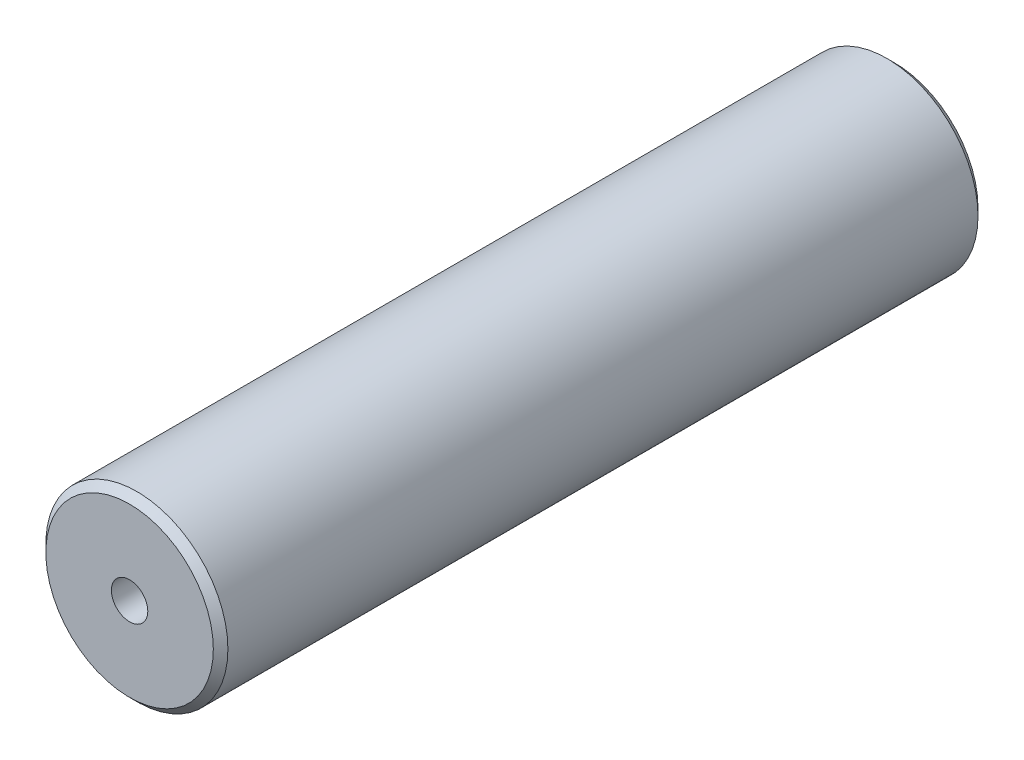
ISO-10303-21;
HEADER;
FILE_DESCRIPTION(('STEP AP214'),'2;1');
FILE_NAME('part.step','',(''),(''),'','','');
FILE_SCHEMA(('AUTOMOTIVE_DESIGN { 1 0 10303 214 1 1 1 1 }'));
ENDSEC;
DATA;
#1=APPLICATION_CONTEXT('core data for automotive mechanical design processes');
#2=APPLICATION_PROTOCOL_DEFINITION('international standard','automotive_design',2000,#1);
#3=PRODUCT_CONTEXT('',#1,'mechanical');
#4=PRODUCT('Part','Part','',(#3));
#5=PRODUCT_RELATED_PRODUCT_CATEGORY('part','',(#4));
#6=PRODUCT_DEFINITION_FORMATION('','',#4);
#7=PRODUCT_DEFINITION_CONTEXT('part definition',#1,'design');
#8=PRODUCT_DEFINITION('design','',#6,#7);
#9=PRODUCT_DEFINITION_SHAPE('','',#8);
#10=(LENGTH_UNIT() NAMED_UNIT(*) SI_UNIT(.MILLI.,.METRE.));
#11=(NAMED_UNIT(*) PLANE_ANGLE_UNIT() SI_UNIT($,.RADIAN.));
#12=(NAMED_UNIT(*) SI_UNIT($,.STERADIAN.) SOLID_ANGLE_UNIT());
#13=UNCERTAINTY_MEASURE_WITH_UNIT(LENGTH_MEASURE(1.E-05),#10,'distance_accuracy_value','');
#14=(GEOMETRIC_REPRESENTATION_CONTEXT(3) GLOBAL_UNCERTAINTY_ASSIGNED_CONTEXT((#13)) GLOBAL_UNIT_ASSIGNED_CONTEXT((#10,
#11,#12)) REPRESENTATION_CONTEXT('',''));
#15=CARTESIAN_POINT('',(0.,0.,0.));
#16=DIRECTION('',(0.,0.,1.));
#17=DIRECTION('',(1.,0.,0.));
#18=AXIS2_PLACEMENT_3D('',#15,#16,#17);
#19=CARTESIAN_POINT('',(0.,0.,52.5));
#20=DIRECTION('',(0.,0.,-1.));
#21=DIRECTION('',(-1.,0.,0.));
#22=AXIS2_PLACEMENT_3D('',#19,#20,#21);
#23=CYLINDRICAL_SURFACE('',#22,12.5);
#24=CARTESIAN_POINT('',(0.,0.,-51.5));
#25=DIRECTION('',(0.,0.,1.));
#26=DIRECTION('',(1.,0.,0.));
#27=AXIS2_PLACEMENT_3D('',#24,#25,#26);
#28=CIRCLE('',#27,12.5);
#29=CARTESIAN_POINT('',(12.5,0.,-51.5));
#30=VERTEX_POINT('',#29);
#31=EDGE_CURVE('E73',#30,#30,#28,.T.);
#32=ORIENTED_EDGE('',*,*,#31,.T.);
#33=EDGE_LOOP('',(#32));
#34=FACE_BOUND('',#33,.T.);
#35=CARTESIAN_POINT('',(0.,0.,51.5));
#36=DIRECTION('',(0.,0.,1.));
#37=DIRECTION('',(1.,0.,0.));
#38=AXIS2_PLACEMENT_3D('',#35,#36,#37);
#39=CIRCLE('',#38,12.5);
#40=CARTESIAN_POINT('',(12.5,0.,51.5));
#41=VERTEX_POINT('',#40);
#42=EDGE_CURVE('E70',#41,#41,#39,.F.);
#43=ORIENTED_EDGE('',*,*,#42,.T.);
#44=EDGE_LOOP('',(#43));
#45=FACE_BOUND('',#44,.T.);
#46=ADVANCED_FACE('F34',(#34,#45),#23,.T.);
#47=CARTESIAN_POINT('',(0.,0.,52.5));
#48=DIRECTION('',(0.,0.,1.));
#49=DIRECTION('',(1.,0.,0.));
#50=AXIS2_PLACEMENT_3D('',#47,#48,#49);
#51=PLANE('',#50);
#52=CARTESIAN_POINT('',(0.,0.,52.5));
#53=DIRECTION('',(0.,0.,1.));
#54=DIRECTION('',(1.,0.,0.));
#55=AXIS2_PLACEMENT_3D('',#52,#53,#54);
#56=CIRCLE('',#55,2.49999999999999);
#57=CARTESIAN_POINT('',(2.49999999999999,0.,52.5));
#58=VERTEX_POINT('',#57);
#59=EDGE_CURVE('E59',#58,#58,#56,.T.);
#60=ORIENTED_EDGE('',*,*,#59,.F.);
#61=EDGE_LOOP('',(#60));
#62=FACE_BOUND('',#61,.T.);
#63=CARTESIAN_POINT('',(0.,0.,52.5));
#64=DIRECTION('',(0.,0.,1.));
#65=DIRECTION('',(1.,0.,0.));
#66=AXIS2_PLACEMENT_3D('',#63,#64,#65);
#67=CIRCLE('',#66,11.5);
#68=CARTESIAN_POINT('',(11.5,0.,52.5));
#69=VERTEX_POINT('',#68);
#70=EDGE_CURVE('E11',#69,#69,#67,.T.);
#71=ORIENTED_EDGE('',*,*,#70,.T.);
#72=EDGE_LOOP('',(#71));
#73=FACE_BOUND('',#72,.T.);
#74=ADVANCED_FACE('F87',(#62,#73),#51,.T.);
#75=CARTESIAN_POINT('',(0.,0.,-52.5));
#76=DIRECTION('',(0.,0.,1.));
#77=DIRECTION('',(1.,0.,0.));
#78=AXIS2_PLACEMENT_3D('',#75,#76,#77);
#79=PLANE('',#78);
#80=CARTESIAN_POINT('',(0.,0.,-52.5));
#81=DIRECTION('',(0.,0.,-1.));
#82=DIRECTION('',(-1.,0.,0.));
#83=AXIS2_PLACEMENT_3D('',#80,#81,#82);
#84=CIRCLE('',#83,2.49999999999999);
#85=CARTESIAN_POINT('',(-2.49999999999999,0.,-52.5));
#86=VERTEX_POINT('',#85);
#87=EDGE_CURVE('E60',#86,#86,#84,.T.);
#88=ORIENTED_EDGE('',*,*,#87,.F.);
#89=EDGE_LOOP('',(#88));
#90=FACE_BOUND('',#89,.T.);
#91=CARTESIAN_POINT('',(0.,0.,-52.5));
#92=DIRECTION('',(0.,0.,1.));
#93=DIRECTION('',(1.,0.,0.));
#94=AXIS2_PLACEMENT_3D('',#91,#92,#93);
#95=CIRCLE('',#94,11.5);
#96=CARTESIAN_POINT('',(11.5,0.,-52.5));
#97=VERTEX_POINT('',#96);
#98=EDGE_CURVE('E43',#97,#97,#95,.F.);
#99=ORIENTED_EDGE('',*,*,#98,.T.);
#100=EDGE_LOOP('',(#99));
#101=FACE_BOUND('',#100,.T.);
#102=ADVANCED_FACE('F78',(#90,#101),#79,.F.);
#103=CARTESIAN_POINT('',(0.,0.,-51.5));
#104=DIRECTION('',(0.,0.,1.));
#105=DIRECTION('',(1.,0.,0.));
#106=AXIS2_PLACEMENT_3D('',#103,#104,#105);
#107=CONICAL_SURFACE('',#106,12.5,0.785398163397458);
#108=ORIENTED_EDGE('',*,*,#98,.F.);
#109=EDGE_LOOP('',(#108));
#110=FACE_BOUND('',#109,.T.);
#111=ORIENTED_EDGE('',*,*,#31,.F.);
#112=EDGE_LOOP('',(#111));
#113=FACE_BOUND('',#112,.T.);
#114=ADVANCED_FACE('F80',(#110,#113),#107,.T.);
#115=CARTESIAN_POINT('',(0.,0.,52.5));
#116=DIRECTION('',(0.,0.,-1.));
#117=DIRECTION('',(-1.,0.,0.));
#118=AXIS2_PLACEMENT_3D('',#115,#116,#117);
#119=CONICAL_SURFACE('',#118,11.5,0.785398163397443);
#120=ORIENTED_EDGE('',*,*,#42,.F.);
#121=EDGE_LOOP('',(#120));
#122=FACE_BOUND('',#121,.T.);
#123=ORIENTED_EDGE('',*,*,#70,.F.);
#124=EDGE_LOOP('',(#123));
#125=FACE_BOUND('',#124,.T.);
#126=ADVANCED_FACE('F37',(#122,#125),#119,.T.);
#127=CARTESIAN_POINT('',(0.,0.,39.5));
#128=DIRECTION('',(0.,0.,1.));
#129=DIRECTION('',(1.,0.,0.));
#130=AXIS2_PLACEMENT_3D('',#127,#128,#129);
#131=CONICAL_SURFACE('',#130,2.5,1.02974425867665);
#132=CARTESIAN_POINT('',(0.,0.,37.9978484524311));
#133=VERTEX_POINT('',#132);
#134=VERTEX_LOOP('',#133);
#135=FACE_BOUND('',#134,.T.);
#136=CARTESIAN_POINT('',(0.,0.,39.5));
#137=DIRECTION('',(0.,0.,1.));
#138=DIRECTION('',(1.,0.,0.));
#139=AXIS2_PLACEMENT_3D('',#136,#137,#138);
#140=CIRCLE('',#139,2.5);
#141=CARTESIAN_POINT('',(2.5,0.,39.5));
#142=VERTEX_POINT('',#141);
#143=EDGE_CURVE('E63',#142,#142,#140,.T.);
#144=ORIENTED_EDGE('',*,*,#143,.T.);
#145=EDGE_LOOP('',(#144));
#146=FACE_BOUND('',#145,.T.);
#147=ADVANCED_FACE('F93',(#135,#146),#131,.F.);
#148=CARTESIAN_POINT('',(0.,0.,52.5));
#149=DIRECTION('',(0.,0.,1.));
#150=DIRECTION('',(1.,0.,0.));
#151=AXIS2_PLACEMENT_3D('',#148,#149,#150);
#152=CYLINDRICAL_SURFACE('',#151,2.49999999999999);
#153=ORIENTED_EDGE('',*,*,#143,.F.);
#154=EDGE_LOOP('',(#153));
#155=FACE_BOUND('',#154,.T.);
#156=ORIENTED_EDGE('',*,*,#59,.T.);
#157=EDGE_LOOP('',(#156));
#158=FACE_BOUND('',#157,.T.);
#159=ADVANCED_FACE('F53',(#155,#158),#152,.F.);
#160=CARTESIAN_POINT('',(0.,0.,-39.5));
#161=DIRECTION('',(0.,0.,-1.));
#162=DIRECTION('',(-1.,0.,0.));
#163=AXIS2_PLACEMENT_3D('',#160,#161,#162);
#164=CONICAL_SURFACE('',#163,2.5,1.02974425867665);
#165=CARTESIAN_POINT('',(0.,0.,-37.9978484524311));
#166=VERTEX_POINT('',#165);
#167=VERTEX_LOOP('',#166);
#168=FACE_BOUND('',#167,.T.);
#169=CARTESIAN_POINT('',(0.,0.,-39.5));
#170=DIRECTION('',(0.,0.,-1.));
#171=DIRECTION('',(-1.,0.,0.));
#172=AXIS2_PLACEMENT_3D('',#169,#170,#171);
#173=CIRCLE('',#172,2.5);
#174=CARTESIAN_POINT('',(-2.5,0.,-39.5));
#175=VERTEX_POINT('',#174);
#176=EDGE_CURVE('E57',#175,#175,#173,.T.);
#177=ORIENTED_EDGE('',*,*,#176,.T.);
#178=EDGE_LOOP('',(#177));
#179=FACE_BOUND('',#178,.T.);
#180=ADVANCED_FACE('F49',(#168,#179),#164,.F.);
#181=CARTESIAN_POINT('',(0.,0.,-52.5));
#182=DIRECTION('',(0.,0.,-1.));
#183=DIRECTION('',(-1.,0.,0.));
#184=AXIS2_PLACEMENT_3D('',#181,#182,#183);
#185=CYLINDRICAL_SURFACE('',#184,2.49999999999999);
#186=ORIENTED_EDGE('',*,*,#176,.F.);
#187=EDGE_LOOP('',(#186));
#188=FACE_BOUND('',#187,.T.);
#189=ORIENTED_EDGE('',*,*,#87,.T.);
#190=EDGE_LOOP('',(#189));
#191=FACE_BOUND('',#190,.T.);
#192=ADVANCED_FACE('F52',(#188,#191),#185,.F.);
#193=CLOSED_SHELL('',(#46,#74,#102,#114,#126,#147,#159,#180,#192));
#194=MANIFOLD_SOLID_BREP('B2',#193);
#195=ADVANCED_BREP_SHAPE_REPRESENTATION('',(#18,#194),#14);
#196=SHAPE_DEFINITION_REPRESENTATION(#9,#195);
ENDSEC;
END-ISO-10303-21;
